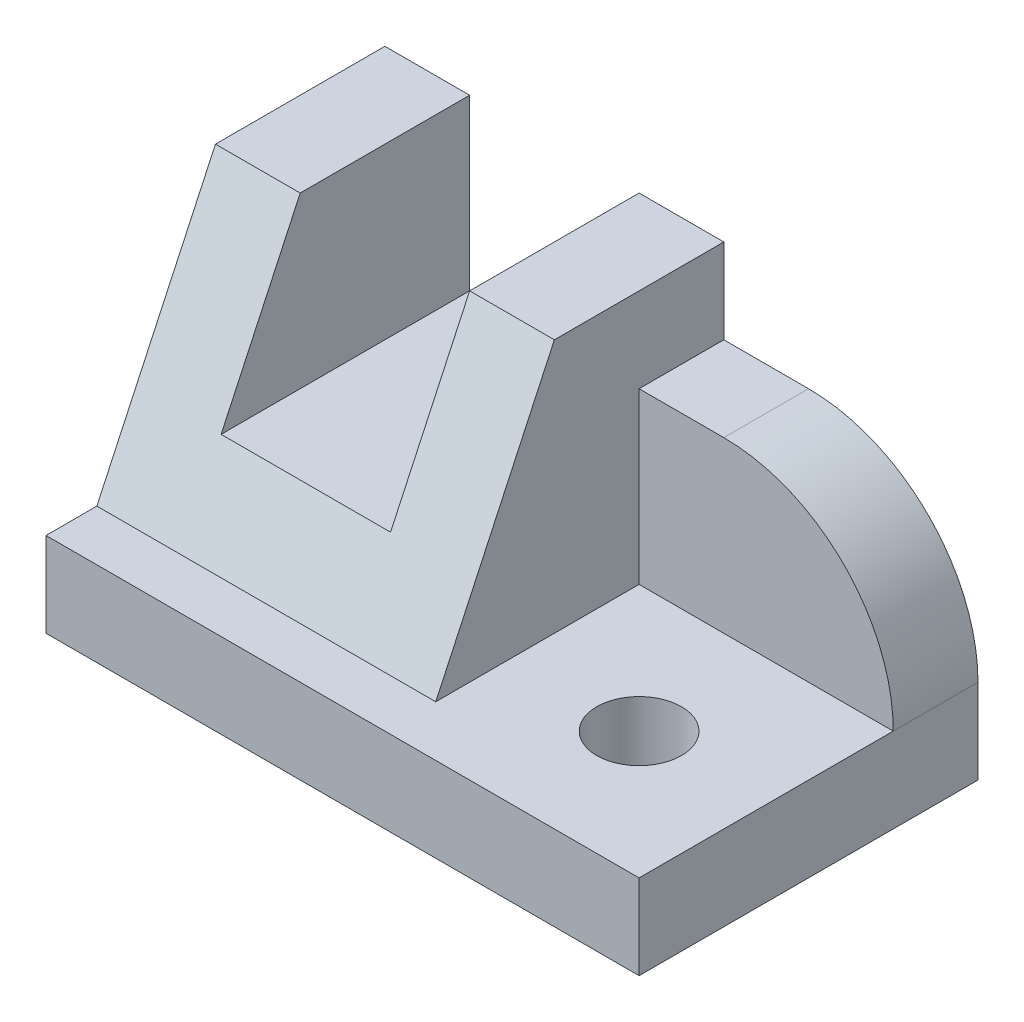
ISO-10303-21;
HEADER;
FILE_DESCRIPTION(('STEP AP214'),'2;1');
FILE_NAME('part.step','',(''),(''),'','','');
FILE_SCHEMA(('AUTOMOTIVE_DESIGN { 1 0 10303 214 1 1 1 1 }'));
ENDSEC;
DATA;
#1=APPLICATION_CONTEXT('core data for automotive mechanical design processes');
#2=APPLICATION_PROTOCOL_DEFINITION('international standard','automotive_design',2000,#1);
#3=PRODUCT_CONTEXT('',#1,'mechanical');
#4=PRODUCT('Part','Part','',(#3));
#5=PRODUCT_RELATED_PRODUCT_CATEGORY('part','',(#4));
#6=PRODUCT_DEFINITION_FORMATION('','',#4);
#7=PRODUCT_DEFINITION_CONTEXT('part definition',#1,'design');
#8=PRODUCT_DEFINITION('design','',#6,#7);
#9=PRODUCT_DEFINITION_SHAPE('','',#8);
#10=(LENGTH_UNIT() NAMED_UNIT(*) SI_UNIT(.MILLI.,.METRE.));
#11=(NAMED_UNIT(*) PLANE_ANGLE_UNIT() SI_UNIT($,.RADIAN.));
#12=(NAMED_UNIT(*) SI_UNIT($,.STERADIAN.) SOLID_ANGLE_UNIT());
#13=UNCERTAINTY_MEASURE_WITH_UNIT(LENGTH_MEASURE(1.E-05),#10,'distance_accuracy_value','');
#14=(GEOMETRIC_REPRESENTATION_CONTEXT(3) GLOBAL_UNCERTAINTY_ASSIGNED_CONTEXT((#13)) GLOBAL_UNIT_ASSIGNED_CONTEXT((#10,
#11,#12)) REPRESENTATION_CONTEXT('',''));
#15=CARTESIAN_POINT('',(0.,0.,0.));
#16=DIRECTION('',(0.,0.,1.));
#17=DIRECTION('',(1.,0.,0.));
#18=AXIS2_PLACEMENT_3D('',#15,#16,#17);
#19=CARTESIAN_POINT('',(40.,40.,-40.));
#20=DIRECTION('',(0.,-1.,0.));
#21=DIRECTION('',(0.,0.,-1.));
#22=AXIS2_PLACEMENT_3D('',#19,#20,#21);
#23=PLANE('',#22);
#24=DIRECTION('',(-1.,0.,0.));
#25=VECTOR('',#24,1.);
#26=CARTESIAN_POINT('',(40.,40.,-20.));
#27=LINE('',#26,#25);
#28=CARTESIAN_POINT('',(9.99999999999998,40.,-20.));
#29=VERTEX_POINT('',#28);
#30=CARTESIAN_POINT('',(0.,40.,-20.));
#31=VERTEX_POINT('',#30);
#32=EDGE_CURVE('E235',#29,#31,#27,.T.);
#33=ORIENTED_EDGE('',*,*,#32,.F.);
#34=DIRECTION('',(0.,0.,-1.));
#35=VECTOR('',#34,1.);
#36=CARTESIAN_POINT('',(9.99999999999998,40.,0.));
#37=LINE('',#36,#35);
#38=CARTESIAN_POINT('',(9.99999999999999,40.,-40.));
#39=VERTEX_POINT('',#38);
#40=EDGE_CURVE('E160',#29,#39,#37,.T.);
#41=ORIENTED_EDGE('',*,*,#40,.T.);
#42=DIRECTION('',(1.,0.,0.));
#43=VECTOR('',#42,1.);
#44=CARTESIAN_POINT('',(40.,40.,-40.));
#45=LINE('',#44,#43);
#46=CARTESIAN_POINT('',(0.,40.,-40.));
#47=VERTEX_POINT('',#46);
#48=EDGE_CURVE('E219',#47,#39,#45,.T.);
#49=ORIENTED_EDGE('',*,*,#48,.F.);
#50=DIRECTION('',(0.,0.,1.));
#51=VECTOR('',#50,1.);
#52=CARTESIAN_POINT('',(0.,40.,-40.));
#53=LINE('',#52,#51);
#54=EDGE_CURVE('E221',#47,#31,#53,.T.);
#55=ORIENTED_EDGE('',*,*,#54,.T.);
#56=EDGE_LOOP('',(#33,#41,#49,#55));
#57=FACE_BOUND('',#56,.T.);
#58=ADVANCED_FACE('F35',(#57),#23,.F.);
#59=CARTESIAN_POINT('',(40.,10.,-6.00000000000001));
#60=DIRECTION('',(0.,0.422885465331124,0.906183139995265));
#61=DIRECTION('',(0.,-0.906183139995265,0.422885465331124));
#62=AXIS2_PLACEMENT_3D('',#59,#60,#61);
#63=PLANE('',#62);
#64=DIRECTION('',(0.,-0.906183139995265,0.422885465331124));
#65=VECTOR('',#64,1.);
#66=CARTESIAN_POINT('',(9.99999999999998,10.,-6.00000000000002));
#67=LINE('',#66,#65);
#68=CARTESIAN_POINT('',(9.99999999999998,20.,-10.6666666666667));
#69=VERTEX_POINT('',#68);
#70=EDGE_CURVE('E168',#29,#69,#67,.T.);
#71=ORIENTED_EDGE('',*,*,#70,.F.);
#72=ORIENTED_EDGE('',*,*,#32,.T.);
#73=DIRECTION('',(0.,0.906183139995265,-0.422885465331124));
#74=VECTOR('',#73,1.);
#75=CARTESIAN_POINT('',(0.,10.,-6.00000000000001));
#76=LINE('',#75,#74);
#77=CARTESIAN_POINT('',(0.,10.,-6.00000000000001));
#78=VERTEX_POINT('',#77);
#79=EDGE_CURVE('E224',#78,#31,#76,.T.);
#80=ORIENTED_EDGE('',*,*,#79,.F.);
#81=DIRECTION('',(-1.,0.,0.));
#82=VECTOR('',#81,1.);
#83=CARTESIAN_POINT('',(40.,10.,-6.00000000000001));
#84=LINE('',#83,#82);
#85=CARTESIAN_POINT('',(40.,10.,-6.00000000000002));
#86=VERTEX_POINT('',#85);
#87=EDGE_CURVE('E228',#86,#78,#84,.T.);
#88=ORIENTED_EDGE('',*,*,#87,.F.);
#89=DIRECTION('',(0.,0.906183139995265,-0.422885465331124));
#90=VECTOR('',#89,1.);
#91=CARTESIAN_POINT('',(40.,10.,-6.00000000000001));
#92=LINE('',#91,#90);
#93=CARTESIAN_POINT('',(40.,40.,-20.));
#94=VERTEX_POINT('',#93);
#95=EDGE_CURVE('E225',#86,#94,#92,.T.);
#96=ORIENTED_EDGE('',*,*,#95,.T.);
#97=CARTESIAN_POINT('',(30.,40.,-20.));
#98=VERTEX_POINT('',#97);
#99=EDGE_CURVE('E231',#94,#98,#27,.T.);
#100=ORIENTED_EDGE('',*,*,#99,.T.);
#101=DIRECTION('',(0.,0.906183139995265,-0.422885465331124));
#102=VECTOR('',#101,1.);
#103=CARTESIAN_POINT('',(30.,10.,-6.00000000000001));
#104=LINE('',#103,#102);
#105=CARTESIAN_POINT('',(30.,20.,-10.6666666666667));
#106=VERTEX_POINT('',#105);
#107=EDGE_CURVE('E163',#106,#98,#104,.T.);
#108=ORIENTED_EDGE('',*,*,#107,.F.);
#109=DIRECTION('',(1.,0.,0.));
#110=VECTOR('',#109,1.);
#111=CARTESIAN_POINT('',(40.,20.,-10.6666666666667));
#112=LINE('',#111,#110);
#113=EDGE_CURVE('E140',#69,#106,#112,.T.);
#114=ORIENTED_EDGE('',*,*,#113,.F.);
#115=EDGE_LOOP('',(#71,#72,#80,#88,#96,#100,#108,#114));
#116=FACE_BOUND('',#115,.T.);
#117=ADVANCED_FACE('F270',(#116),#63,.T.);
#118=CARTESIAN_POINT('',(0.,0.,0.));
#119=DIRECTION('',(1.,0.,0.));
#120=DIRECTION('',(0.,0.,-1.));
#121=AXIS2_PLACEMENT_3D('',#118,#119,#120);
#122=PLANE('',#121);
#123=DIRECTION('',(0.,1.,0.));
#124=VECTOR('',#123,1.);
#125=CARTESIAN_POINT('',(0.,40.,-40.));
#126=LINE('',#125,#124);
#127=CARTESIAN_POINT('',(0.,0.,-40.));
#128=VERTEX_POINT('',#127);
#129=EDGE_CURVE('E216',#128,#47,#126,.T.);
#130=ORIENTED_EDGE('',*,*,#129,.F.);
#131=DIRECTION('',(0.,0.,-1.));
#132=VECTOR('',#131,1.);
#133=CARTESIAN_POINT('',(0.,0.,-40.));
#134=LINE('',#133,#132);
#135=CARTESIAN_POINT('',(0.,0.,0.));
#136=VERTEX_POINT('',#135);
#137=EDGE_CURVE('E174',#136,#128,#134,.T.);
#138=ORIENTED_EDGE('',*,*,#137,.F.);
#139=DIRECTION('',(0.,1.,0.));
#140=VECTOR('',#139,1.);
#141=CARTESIAN_POINT('',(0.,0.,0.));
#142=LINE('',#141,#140);
#143=CARTESIAN_POINT('',(0.,10.,0.));
#144=VERTEX_POINT('',#143);
#145=EDGE_CURVE('E192',#136,#144,#142,.T.);
#146=ORIENTED_EDGE('',*,*,#145,.T.);
#147=DIRECTION('',(0.,0.,-1.));
#148=VECTOR('',#147,1.);
#149=CARTESIAN_POINT('',(0.,10.,-40.));
#150=LINE('',#149,#148);
#151=EDGE_CURVE('E186',#144,#78,#150,.T.);
#152=ORIENTED_EDGE('',*,*,#151,.T.);
#153=ORIENTED_EDGE('',*,*,#79,.T.);
#154=ORIENTED_EDGE('',*,*,#54,.F.);
#155=EDGE_LOOP('',(#130,#138,#146,#152,#153,#154));
#156=FACE_BOUND('',#155,.T.);
#157=ADVANCED_FACE('F273',(#156),#122,.F.);
#158=CARTESIAN_POINT('',(30.,40.,-40.));
#159=VERTEX_POINT('',#158);
#160=CARTESIAN_POINT('',(40.,40.,-40.));
#161=VERTEX_POINT('',#160);
#162=EDGE_CURVE('E218',#159,#161,#45,.T.);
#163=ORIENTED_EDGE('',*,*,#162,.F.);
#164=DIRECTION('',(0.,0.,-1.));
#165=VECTOR('',#164,1.);
#166=CARTESIAN_POINT('',(30.,40.,0.));
#167=LINE('',#166,#165);
#168=EDGE_CURVE('E144',#98,#159,#167,.T.);
#169=ORIENTED_EDGE('',*,*,#168,.F.);
#170=ORIENTED_EDGE('',*,*,#99,.F.);
#171=DIRECTION('',(0.,0.,1.));
#172=VECTOR('',#171,1.);
#173=CARTESIAN_POINT('',(40.,40.,-40.));
#174=LINE('',#173,#172);
#175=EDGE_CURVE('E195',#161,#94,#174,.T.);
#176=ORIENTED_EDGE('',*,*,#175,.F.);
#177=EDGE_LOOP('',(#163,#169,#170,#176));
#178=FACE_BOUND('',#177,.T.);
#179=ADVANCED_FACE('F267',(#178),#23,.F.);
#180=CARTESIAN_POINT('',(0.,0.,-40.));
#181=DIRECTION('',(0.,0.,1.));
#182=DIRECTION('',(0.,-1.,0.));
#183=AXIS2_PLACEMENT_3D('',#180,#181,#182);
#184=PLANE('',#183);
#185=DIRECTION('',(1.,0.,0.));
#186=VECTOR('',#185,1.);
#187=CARTESIAN_POINT('',(40.,30.,-40.));
#188=LINE('',#187,#186);
#189=CARTESIAN_POINT('',(40.,30.,-40.));
#190=VERTEX_POINT('',#189);
#191=CARTESIAN_POINT('',(50.,30.,-40.));
#192=VERTEX_POINT('',#191);
#193=EDGE_CURVE('E209',#190,#192,#188,.T.);
#194=ORIENTED_EDGE('',*,*,#193,.T.);
#195=CARTESIAN_POINT('',(50.,9.99999999999999,-40.));
#196=DIRECTION('',(0.,0.,1.));
#197=DIRECTION('',(0.,-1.,0.));
#198=AXIS2_PLACEMENT_3D('',#195,#196,#197);
#199=CIRCLE('',#198,20.);
#200=CARTESIAN_POINT('',(70.,10.,-40.));
#201=VERTEX_POINT('',#200);
#202=EDGE_CURVE('E50',#192,#201,#199,.F.);
#203=ORIENTED_EDGE('',*,*,#202,.T.);
#204=DIRECTION('',(0.,1.,0.));
#205=VECTOR('',#204,1.);
#206=CARTESIAN_POINT('',(70.,40.,-40.));
#207=LINE('',#206,#205);
#208=CARTESIAN_POINT('',(70.,0.,-40.));
#209=VERTEX_POINT('',#208);
#210=EDGE_CURVE('E211',#209,#201,#207,.T.);
#211=ORIENTED_EDGE('',*,*,#210,.F.);
#212=DIRECTION('',(1.,0.,0.));
#213=VECTOR('',#212,1.);
#214=CARTESIAN_POINT('',(70.,0.,-40.));
#215=LINE('',#214,#213);
#216=EDGE_CURVE('E178',#128,#209,#215,.T.);
#217=ORIENTED_EDGE('',*,*,#216,.F.);
#218=ORIENTED_EDGE('',*,*,#129,.T.);
#219=ORIENTED_EDGE('',*,*,#48,.T.);
#220=DIRECTION('',(0.,1.,0.));
#221=VECTOR('',#220,1.);
#222=CARTESIAN_POINT('',(9.99999999999999,20.,-40.));
#223=LINE('',#222,#221);
#224=CARTESIAN_POINT('',(9.99999999999999,20.,-40.));
#225=VERTEX_POINT('',#224);
#226=EDGE_CURVE('E155',#225,#39,#223,.T.);
#227=ORIENTED_EDGE('',*,*,#226,.F.);
#228=DIRECTION('',(-1.,0.,0.));
#229=VECTOR('',#228,1.);
#230=CARTESIAN_POINT('',(30.,20.,-40.));
#231=LINE('',#230,#229);
#232=CARTESIAN_POINT('',(30.,20.,-40.));
#233=VERTEX_POINT('',#232);
#234=EDGE_CURVE('E137',#233,#225,#231,.T.);
#235=ORIENTED_EDGE('',*,*,#234,.F.);
#236=DIRECTION('',(0.,-1.,0.));
#237=VECTOR('',#236,1.);
#238=CARTESIAN_POINT('',(30.,40.,-40.));
#239=LINE('',#238,#237);
#240=EDGE_CURVE('E147',#159,#233,#239,.T.);
#241=ORIENTED_EDGE('',*,*,#240,.F.);
#242=ORIENTED_EDGE('',*,*,#162,.T.);
#243=DIRECTION('',(0.,1.,0.));
#244=VECTOR('',#243,1.);
#245=CARTESIAN_POINT('',(40.,30.,-40.));
#246=LINE('',#245,#244);
#247=EDGE_CURVE('E205',#190,#161,#246,.T.);
#248=ORIENTED_EDGE('',*,*,#247,.F.);
#249=EDGE_LOOP('',(#194,#203,#211,#217,#218,#219,#227,#235,#241,#242,#248));
#250=FACE_BOUND('',#249,.T.);
#251=ADVANCED_FACE('F153',(#250),#184,.F.);
#252=CARTESIAN_POINT('',(70.,0.,0.));
#253=DIRECTION('',(-1.,0.,0.));
#254=DIRECTION('',(0.,0.,1.));
#255=AXIS2_PLACEMENT_3D('',#252,#253,#254);
#256=PLANE('',#255);
#257=ORIENTED_EDGE('',*,*,#210,.T.);
#258=DIRECTION('',(0.,0.,-1.));
#259=VECTOR('',#258,1.);
#260=CARTESIAN_POINT('',(70.,9.99999999999999,0.));
#261=LINE('',#260,#259);
#262=CARTESIAN_POINT('',(70.,10.,-30.));
#263=VERTEX_POINT('',#262);
#264=EDGE_CURVE('E43',#201,#263,#261,.F.);
#265=ORIENTED_EDGE('',*,*,#264,.T.);
#266=DIRECTION('',(0.,0.,1.));
#267=VECTOR('',#266,1.);
#268=CARTESIAN_POINT('',(70.,10.,0.));
#269=LINE('',#268,#267);
#270=CARTESIAN_POINT('',(70.,10.,0.));
#271=VERTEX_POINT('',#270);
#272=EDGE_CURVE('E175',#263,#271,#269,.T.);
#273=ORIENTED_EDGE('',*,*,#272,.T.);
#274=DIRECTION('',(0.,1.,0.));
#275=VECTOR('',#274,1.);
#276=CARTESIAN_POINT('',(70.,0.,0.));
#277=LINE('',#276,#275);
#278=CARTESIAN_POINT('',(70.,0.,0.));
#279=VERTEX_POINT('',#278);
#280=EDGE_CURVE('E183',#279,#271,#277,.T.);
#281=ORIENTED_EDGE('',*,*,#280,.F.);
#282=DIRECTION('',(0.,0.,1.));
#283=VECTOR('',#282,1.);
#284=CARTESIAN_POINT('',(70.,0.,0.));
#285=LINE('',#284,#283);
#286=EDGE_CURVE('E181',#209,#279,#285,.T.);
#287=ORIENTED_EDGE('',*,*,#286,.F.);
#288=EDGE_LOOP('',(#257,#265,#273,#281,#287));
#289=FACE_BOUND('',#288,.T.);
#290=ADVANCED_FACE('F245',(#289),#256,.F.);
#291=CARTESIAN_POINT('',(40.,30.,-30.));
#292=DIRECTION('',(0.,-1.,0.));
#293=DIRECTION('',(0.,0.,-1.));
#294=AXIS2_PLACEMENT_3D('',#291,#292,#293);
#295=PLANE('',#294);
#296=DIRECTION('',(1.,0.,0.));
#297=VECTOR('',#296,1.);
#298=CARTESIAN_POINT('',(40.,30.,-30.));
#299=LINE('',#298,#297);
#300=CARTESIAN_POINT('',(40.,30.,-30.));
#301=VERTEX_POINT('',#300);
#302=CARTESIAN_POINT('',(50.,30.,-30.));
#303=VERTEX_POINT('',#302);
#304=EDGE_CURVE('E212',#301,#303,#299,.T.);
#305=ORIENTED_EDGE('',*,*,#304,.T.);
#306=DIRECTION('',(0.,0.,-1.));
#307=VECTOR('',#306,1.);
#308=CARTESIAN_POINT('',(50.,30.,-30.));
#309=LINE('',#308,#307);
#310=EDGE_CURVE('E234',#303,#192,#309,.T.);
#311=ORIENTED_EDGE('',*,*,#310,.T.);
#312=ORIENTED_EDGE('',*,*,#193,.F.);
#313=DIRECTION('',(0.,0.,-1.));
#314=VECTOR('',#313,1.);
#315=CARTESIAN_POINT('',(40.,30.,-30.));
#316=LINE('',#315,#314);
#317=EDGE_CURVE('E202',#301,#190,#316,.T.);
#318=ORIENTED_EDGE('',*,*,#317,.F.);
#319=EDGE_LOOP('',(#305,#311,#312,#318));
#320=FACE_BOUND('',#319,.T.);
#321=ADVANCED_FACE('F259',(#320),#295,.F.);
#322=CARTESIAN_POINT('',(40.,10.,-30.));
#323=DIRECTION('',(0.,0.,-1.));
#324=DIRECTION('',(-1.,0.,0.));
#325=AXIS2_PLACEMENT_3D('',#322,#323,#324);
#326=PLANE('',#325);
#327=DIRECTION('',(1.,0.,0.));
#328=VECTOR('',#327,1.);
#329=CARTESIAN_POINT('',(40.,10.,-30.));
#330=LINE('',#329,#328);
#331=CARTESIAN_POINT('',(40.,10.,-30.));
#332=VERTEX_POINT('',#331);
#333=EDGE_CURVE('E208',#332,#263,#330,.T.);
#334=ORIENTED_EDGE('',*,*,#333,.T.);
#335=CARTESIAN_POINT('',(50.,9.99999999999999,-30.));
#336=DIRECTION('',(0.,0.,-1.));
#337=DIRECTION('',(-1.,0.,0.));
#338=AXIS2_PLACEMENT_3D('',#335,#336,#337);
#339=CIRCLE('',#338,20.);
#340=EDGE_CURVE('E11',#263,#303,#339,.F.);
#341=ORIENTED_EDGE('',*,*,#340,.T.);
#342=ORIENTED_EDGE('',*,*,#304,.F.);
#343=DIRECTION('',(0.,1.,0.));
#344=VECTOR('',#343,1.);
#345=CARTESIAN_POINT('',(40.,10.,-30.));
#346=LINE('',#345,#344);
#347=EDGE_CURVE('E199',#332,#301,#346,.T.);
#348=ORIENTED_EDGE('',*,*,#347,.F.);
#349=EDGE_LOOP('',(#334,#341,#342,#348));
#350=FACE_BOUND('',#349,.T.);
#351=ADVANCED_FACE('F252',(#350),#326,.F.);
#352=CARTESIAN_POINT('',(40.,0.,0.));
#353=DIRECTION('',(-1.,0.,0.));
#354=DIRECTION('',(0.,0.,1.));
#355=AXIS2_PLACEMENT_3D('',#352,#353,#354);
#356=PLANE('',#355);
#357=ORIENTED_EDGE('',*,*,#95,.F.);
#358=DIRECTION('',(0.,0.,-1.));
#359=VECTOR('',#358,1.);
#360=CARTESIAN_POINT('',(40.,10.,0.));
#361=LINE('',#360,#359);
#362=EDGE_CURVE('E197',#86,#332,#361,.T.);
#363=ORIENTED_EDGE('',*,*,#362,.T.);
#364=ORIENTED_EDGE('',*,*,#347,.T.);
#365=ORIENTED_EDGE('',*,*,#317,.T.);
#366=ORIENTED_EDGE('',*,*,#247,.T.);
#367=ORIENTED_EDGE('',*,*,#175,.T.);
#368=EDGE_LOOP('',(#357,#363,#364,#365,#366,#367));
#369=FACE_BOUND('',#368,.T.);
#370=ADVANCED_FACE('F264',(#369),#356,.F.);
#371=CARTESIAN_POINT('',(0.,10.,0.));
#372=DIRECTION('',(0.,1.,0.));
#373=DIRECTION('',(0.,0.,1.));
#374=AXIS2_PLACEMENT_3D('',#371,#372,#373);
#375=PLANE('',#374);
#376=CARTESIAN_POINT('',(55.,10.,-15.));
#377=DIRECTION('',(0.,1.,0.));
#378=DIRECTION('',(0.,0.,1.));
#379=AXIS2_PLACEMENT_3D('',#376,#377,#378);
#380=CIRCLE('',#379,4.99999999999998);
#381=CARTESIAN_POINT('',(55.,10.,-10.));
#382=VERTEX_POINT('',#381);
#383=EDGE_CURVE('E151',#382,#382,#380,.T.);
#384=ORIENTED_EDGE('',*,*,#383,.F.);
#385=EDGE_LOOP('',(#384));
#386=FACE_BOUND('',#385,.T.);
#387=ORIENTED_EDGE('',*,*,#333,.F.);
#388=ORIENTED_EDGE('',*,*,#362,.F.);
#389=ORIENTED_EDGE('',*,*,#87,.T.);
#390=ORIENTED_EDGE('',*,*,#151,.F.);
#391=DIRECTION('',(-1.,0.,0.));
#392=VECTOR('',#391,1.);
#393=CARTESIAN_POINT('',(0.,10.,0.));
#394=LINE('',#393,#392);
#395=EDGE_CURVE('E170',#271,#144,#394,.T.);
#396=ORIENTED_EDGE('',*,*,#395,.F.);
#397=ORIENTED_EDGE('',*,*,#272,.F.);
#398=EDGE_LOOP('',(#387,#388,#389,#390,#396,#397));
#399=FACE_BOUND('',#398,.T.);
#400=ADVANCED_FACE('F256',(#386,#399),#375,.T.);
#401=CARTESIAN_POINT('',(0.,0.,0.));
#402=DIRECTION('',(0.,0.,-1.));
#403=DIRECTION('',(-1.,0.,0.));
#404=AXIS2_PLACEMENT_3D('',#401,#402,#403);
#405=PLANE('',#404);
#406=ORIENTED_EDGE('',*,*,#395,.T.);
#407=ORIENTED_EDGE('',*,*,#145,.F.);
#408=DIRECTION('',(-1.,0.,0.));
#409=VECTOR('',#408,1.);
#410=CARTESIAN_POINT('',(0.,0.,0.));
#411=LINE('',#410,#409);
#412=EDGE_CURVE('E171',#279,#136,#411,.T.);
#413=ORIENTED_EDGE('',*,*,#412,.F.);
#414=ORIENTED_EDGE('',*,*,#280,.T.);
#415=EDGE_LOOP('',(#406,#407,#413,#414));
#416=FACE_BOUND('',#415,.T.);
#417=ADVANCED_FACE('F278',(#416),#405,.F.);
#418=CARTESIAN_POINT('',(0.,0.,0.));
#419=DIRECTION('',(0.,1.,0.));
#420=DIRECTION('',(0.,0.,1.));
#421=AXIS2_PLACEMENT_3D('',#418,#419,#420);
#422=PLANE('',#421);
#423=CARTESIAN_POINT('',(55.,0.,-15.));
#424=DIRECTION('',(0.,-1.,0.));
#425=DIRECTION('',(0.,0.,-1.));
#426=AXIS2_PLACEMENT_3D('',#423,#424,#425);
#427=CIRCLE('',#426,4.99999999999998);
#428=CARTESIAN_POINT('',(55.,0.,-20.));
#429=VERTEX_POINT('',#428);
#430=EDGE_CURVE('E240',#429,#429,#427,.T.);
#431=ORIENTED_EDGE('',*,*,#430,.F.);
#432=EDGE_LOOP('',(#431));
#433=FACE_BOUND('',#432,.T.);
#434=ORIENTED_EDGE('',*,*,#412,.T.);
#435=ORIENTED_EDGE('',*,*,#137,.T.);
#436=ORIENTED_EDGE('',*,*,#216,.T.);
#437=ORIENTED_EDGE('',*,*,#286,.T.);
#438=EDGE_LOOP('',(#434,#435,#436,#437));
#439=FACE_BOUND('',#438,.T.);
#440=ADVANCED_FACE('F280',(#433,#439),#422,.F.);
#441=CARTESIAN_POINT('',(9.99999999999998,20.,0.));
#442=DIRECTION('',(-1.,0.,0.));
#443=DIRECTION('',(0.,0.,1.));
#444=AXIS2_PLACEMENT_3D('',#441,#442,#443);
#445=PLANE('',#444);
#446=ORIENTED_EDGE('',*,*,#70,.T.);
#447=DIRECTION('',(0.,0.,-1.));
#448=VECTOR('',#447,1.);
#449=CARTESIAN_POINT('',(9.99999999999998,20.,0.));
#450=LINE('',#449,#448);
#451=EDGE_CURVE('E143',#69,#225,#450,.T.);
#452=ORIENTED_EDGE('',*,*,#451,.T.);
#453=ORIENTED_EDGE('',*,*,#226,.T.);
#454=ORIENTED_EDGE('',*,*,#40,.F.);
#455=EDGE_LOOP('',(#446,#452,#453,#454));
#456=FACE_BOUND('',#455,.T.);
#457=ADVANCED_FACE('F286',(#456),#445,.F.);
#458=CARTESIAN_POINT('',(30.,20.,0.));
#459=DIRECTION('',(0.,-1.,0.));
#460=DIRECTION('',(0.,0.,-1.));
#461=AXIS2_PLACEMENT_3D('',#458,#459,#460);
#462=PLANE('',#461);
#463=ORIENTED_EDGE('',*,*,#113,.T.);
#464=DIRECTION('',(0.,0.,-1.));
#465=VECTOR('',#464,1.);
#466=CARTESIAN_POINT('',(30.,20.,0.));
#467=LINE('',#466,#465);
#468=EDGE_CURVE('E132',#106,#233,#467,.T.);
#469=ORIENTED_EDGE('',*,*,#468,.T.);
#470=ORIENTED_EDGE('',*,*,#234,.T.);
#471=ORIENTED_EDGE('',*,*,#451,.F.);
#472=EDGE_LOOP('',(#463,#469,#470,#471));
#473=FACE_BOUND('',#472,.T.);
#474=ADVANCED_FACE('F134',(#473),#462,.F.);
#475=CARTESIAN_POINT('',(30.,40.,0.));
#476=DIRECTION('',(1.,0.,0.));
#477=DIRECTION('',(0.,0.,-1.));
#478=AXIS2_PLACEMENT_3D('',#475,#476,#477);
#479=PLANE('',#478);
#480=ORIENTED_EDGE('',*,*,#107,.T.);
#481=ORIENTED_EDGE('',*,*,#168,.T.);
#482=ORIENTED_EDGE('',*,*,#240,.T.);
#483=ORIENTED_EDGE('',*,*,#468,.F.);
#484=EDGE_LOOP('',(#480,#481,#482,#483));
#485=FACE_BOUND('',#484,.T.);
#486=ADVANCED_FACE('F148',(#485),#479,.F.);
#487=CARTESIAN_POINT('',(55.,0.,-15.));
#488=DIRECTION('',(0.,-1.,0.));
#489=DIRECTION('',(0.,0.,-1.));
#490=AXIS2_PLACEMENT_3D('',#487,#488,#489);
#491=CYLINDRICAL_SURFACE('',#490,4.99999999999998);
#492=ORIENTED_EDGE('',*,*,#383,.T.);
#493=EDGE_LOOP('',(#492));
#494=FACE_BOUND('',#493,.T.);
#495=ORIENTED_EDGE('',*,*,#430,.T.);
#496=EDGE_LOOP('',(#495));
#497=FACE_BOUND('',#496,.T.);
#498=ADVANCED_FACE('F346',(#494,#497),#491,.F.);
#499=CARTESIAN_POINT('',(50.,9.99999999999999,-30.));
#500=DIRECTION('',(0.,0.,-1.));
#501=DIRECTION('',(-1.,0.,0.));
#502=AXIS2_PLACEMENT_3D('',#499,#500,#501);
#503=CYLINDRICAL_SURFACE('',#502,20.);
#504=ORIENTED_EDGE('',*,*,#340,.F.);
#505=ORIENTED_EDGE('',*,*,#264,.F.);
#506=ORIENTED_EDGE('',*,*,#202,.F.);
#507=ORIENTED_EDGE('',*,*,#310,.F.);
#508=EDGE_LOOP('',(#504,#505,#506,#507));
#509=FACE_BOUND('',#508,.T.);
#510=ADVANCED_FACE('F37',(#509),#503,.T.);
#511=CLOSED_SHELL('',(#58,#117,#157,#179,#251,#290,#321,#351,#370,#400,#417,#440,#457,#474,#486,
#498,#510));
#512=MANIFOLD_SOLID_BREP('B2',#511);
#513=ADVANCED_BREP_SHAPE_REPRESENTATION('',(#18,#512),#14);
#514=SHAPE_DEFINITION_REPRESENTATION(#9,#513);
ENDSEC;
END-ISO-10303-21;
